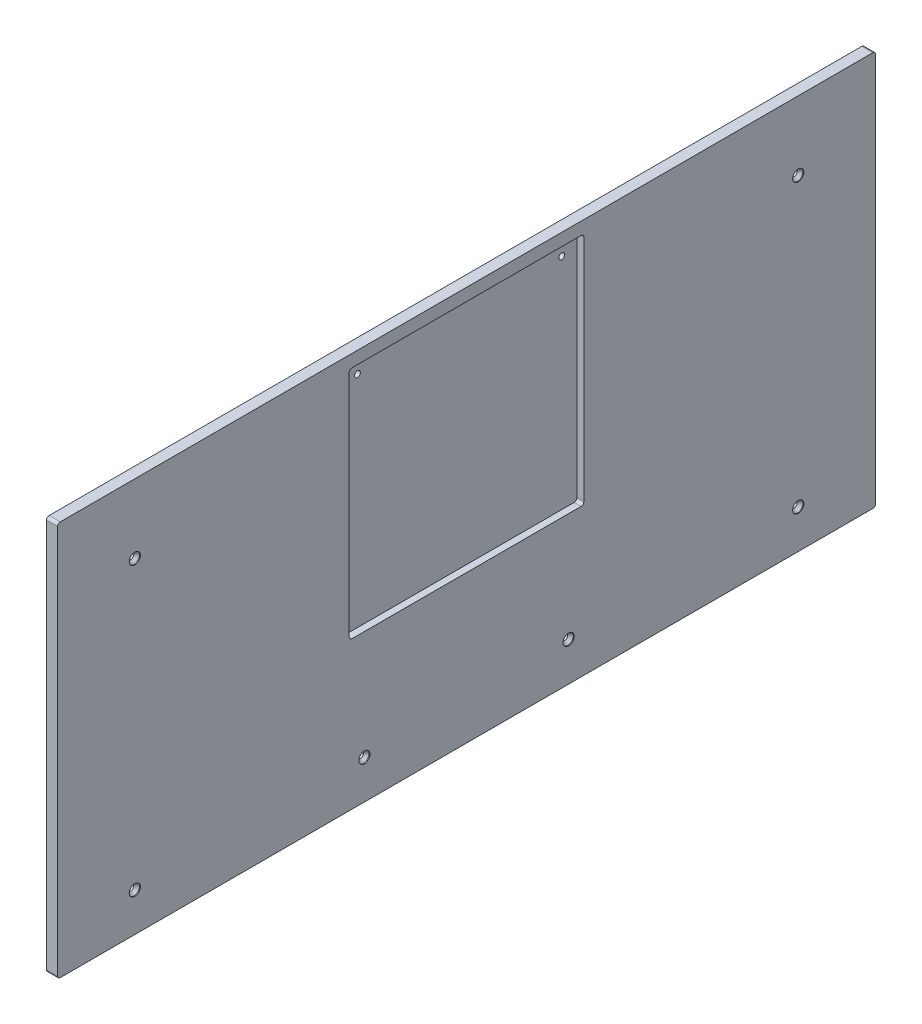
ISO-10303-21;
HEADER;
FILE_DESCRIPTION(('STEP AP214'),'2;1');
FILE_NAME('part.step','',(''),(''),'','','');
FILE_SCHEMA(('AUTOMOTIVE_DESIGN { 1 0 10303 214 1 1 1 1 }'));
ENDSEC;
DATA;
#1=APPLICATION_CONTEXT('core data for automotive mechanical design processes');
#2=APPLICATION_PROTOCOL_DEFINITION('international standard','automotive_design',2000,#1);
#3=PRODUCT_CONTEXT('',#1,'mechanical');
#4=PRODUCT('Part','Part','',(#3));
#5=PRODUCT_RELATED_PRODUCT_CATEGORY('part','',(#4));
#6=PRODUCT_DEFINITION_FORMATION('','',#4);
#7=PRODUCT_DEFINITION_CONTEXT('part definition',#1,'design');
#8=PRODUCT_DEFINITION('design','',#6,#7);
#9=PRODUCT_DEFINITION_SHAPE('','',#8);
#10=(LENGTH_UNIT() NAMED_UNIT(*) SI_UNIT(.MILLI.,.METRE.));
#11=(NAMED_UNIT(*) PLANE_ANGLE_UNIT() SI_UNIT($,.RADIAN.));
#12=(NAMED_UNIT(*) SI_UNIT($,.STERADIAN.) SOLID_ANGLE_UNIT());
#13=UNCERTAINTY_MEASURE_WITH_UNIT(LENGTH_MEASURE(1.E-05),#10,'distance_accuracy_value','');
#14=(GEOMETRIC_REPRESENTATION_CONTEXT(3) GLOBAL_UNCERTAINTY_ASSIGNED_CONTEXT((#13)) GLOBAL_UNIT_ASSIGNED_CONTEXT((#10,
#11,#12)) REPRESENTATION_CONTEXT('',''));
#15=CARTESIAN_POINT('',(0.,0.,0.));
#16=DIRECTION('',(0.,0.,1.));
#17=DIRECTION('',(1.,0.,0.));
#18=AXIS2_PLACEMENT_3D('',#15,#16,#17);
#19=CARTESIAN_POINT('',(0.,0.,0.));
#20=DIRECTION('',(-1.,0.,0.));
#21=DIRECTION('',(0.,0.,1.));
#22=AXIS2_PLACEMENT_3D('',#19,#20,#21);
#23=PLANE('',#22);
#24=CARTESIAN_POINT('',(0.,374.65,-88.9));
#25=DIRECTION('',(1.,0.,0.));
#26=DIRECTION('',(0.,0.,-1.));
#27=AXIS2_PLACEMENT_3D('',#24,#25,#26);
#28=CIRCLE('',#27,3.3782);
#29=CARTESIAN_POINT('',(0.,374.65,-92.2782));
#30=VERTEX_POINT('',#29);
#31=EDGE_CURVE('E509',#30,#30,#28,.T.);
#32=ORIENTED_EDGE('',*,*,#31,.T.);
#33=EDGE_LOOP('',(#32));
#34=FACE_BOUND('',#33,.T.);
#35=CARTESIAN_POINT('',(0.,374.65,-851.98204));
#36=DIRECTION('',(1.,0.,0.));
#37=DIRECTION('',(0.,0.,-1.));
#38=AXIS2_PLACEMENT_3D('',#35,#36,#37);
#39=CIRCLE('',#38,3.3782);
#40=CARTESIAN_POINT('',(0.,374.65,-855.36024));
#41=VERTEX_POINT('',#40);
#42=EDGE_CURVE('E524',#41,#41,#39,.T.);
#43=ORIENTED_EDGE('',*,*,#42,.T.);
#44=EDGE_LOOP('',(#43));
#45=FACE_BOUND('',#44,.T.);
#46=CARTESIAN_POINT('',(0.,44.45,-88.9));
#47=DIRECTION('',(1.,0.,0.));
#48=DIRECTION('',(0.,0.,-1.));
#49=AXIS2_PLACEMENT_3D('',#46,#47,#48);
#50=CIRCLE('',#49,3.3782);
#51=CARTESIAN_POINT('',(0.,44.45,-92.2782));
#52=VERTEX_POINT('',#51);
#53=EDGE_CURVE('E540',#52,#52,#50,.T.);
#54=ORIENTED_EDGE('',*,*,#53,.T.);
#55=EDGE_LOOP('',(#54));
#56=FACE_BOUND('',#55,.T.);
#57=CARTESIAN_POINT('',(0.,44.45,-352.96602));
#58=DIRECTION('',(1.,0.,0.));
#59=DIRECTION('',(0.,0.,-1.));
#60=AXIS2_PLACEMENT_3D('',#57,#58,#59);
#61=CIRCLE('',#60,3.3782);
#62=CARTESIAN_POINT('',(0.,44.45,-356.34422));
#63=VERTEX_POINT('',#62);
#64=EDGE_CURVE('E556',#63,#63,#61,.T.);
#65=ORIENTED_EDGE('',*,*,#64,.T.);
#66=EDGE_LOOP('',(#65));
#67=FACE_BOUND('',#66,.T.);
#68=CARTESIAN_POINT('',(0.,422.275,-587.91602));
#69=DIRECTION('',(1.,0.,0.));
#70=DIRECTION('',(0.,0.,-1.));
#71=AXIS2_PLACEMENT_3D('',#68,#69,#70);
#72=CIRCLE('',#71,3.37343749999991);
#73=CARTESIAN_POINT('',(0.,422.275,-591.2894575));
#74=VERTEX_POINT('',#73);
#75=EDGE_CURVE('E338',#74,#74,#72,.T.);
#76=ORIENTED_EDGE('',*,*,#75,.T.);
#77=EDGE_LOOP('',(#76));
#78=FACE_BOUND('',#77,.T.);
#79=DIRECTION('',(0.,0.,1.));
#80=VECTOR('',#79,1.);
#81=CARTESIAN_POINT('',(0.,454.025,0.));
#82=LINE('',#81,#80);
#83=CARTESIAN_POINT('',(0.,454.025,-937.70704));
#84=VERTEX_POINT('',#83);
#85=CARTESIAN_POINT('',(0.,454.025,-3.175));
#86=VERTEX_POINT('',#85);
#87=EDGE_CURVE('E169',#84,#86,#82,.T.);
#88=ORIENTED_EDGE('',*,*,#87,.F.);
#89=CARTESIAN_POINT('',(0.,450.85,-937.70704));
#90=DIRECTION('',(-1.,0.,0.));
#91=DIRECTION('',(0.,0.,1.));
#92=AXIS2_PLACEMENT_3D('',#89,#90,#91);
#93=CIRCLE('',#92,3.175);
#94=CARTESIAN_POINT('',(0.,450.85,-940.88204));
#95=VERTEX_POINT('',#94);
#96=EDGE_CURVE('E151',#84,#95,#93,.T.);
#97=ORIENTED_EDGE('',*,*,#96,.T.);
#98=DIRECTION('',(0.,1.,0.));
#99=VECTOR('',#98,1.);
#100=CARTESIAN_POINT('',(0.,0.,-940.88204));
#101=LINE('',#100,#99);
#102=CARTESIAN_POINT('',(0.,3.175,-940.88204));
#103=VERTEX_POINT('',#102);
#104=EDGE_CURVE('E181',#103,#95,#101,.T.);
#105=ORIENTED_EDGE('',*,*,#104,.F.);
#106=CARTESIAN_POINT('',(0.,3.175,-937.70704));
#107=DIRECTION('',(-1.,0.,0.));
#108=DIRECTION('',(0.,0.,1.));
#109=AXIS2_PLACEMENT_3D('',#106,#107,#108);
#110=CIRCLE('',#109,3.175);
#111=CARTESIAN_POINT('',(0.,0.,-937.70704));
#112=VERTEX_POINT('',#111);
#113=EDGE_CURVE('E163',#103,#112,#110,.T.);
#114=ORIENTED_EDGE('',*,*,#113,.T.);
#115=DIRECTION('',(0.,0.,-1.));
#116=VECTOR('',#115,1.);
#117=CARTESIAN_POINT('',(0.,0.,0.));
#118=LINE('',#117,#116);
#119=CARTESIAN_POINT('',(0.,0.,-3.175));
#120=VERTEX_POINT('',#119);
#121=EDGE_CURVE('E189',#120,#112,#118,.T.);
#122=ORIENTED_EDGE('',*,*,#121,.F.);
#123=CARTESIAN_POINT('',(0.,3.175,-3.175));
#124=DIRECTION('',(-1.,0.,0.));
#125=DIRECTION('',(0.,0.,1.));
#126=AXIS2_PLACEMENT_3D('',#123,#124,#125);
#127=CIRCLE('',#126,3.175);
#128=CARTESIAN_POINT('',(0.,3.175,0.));
#129=VERTEX_POINT('',#128);
#130=EDGE_CURVE('E197',#120,#129,#127,.T.);
#131=ORIENTED_EDGE('',*,*,#130,.T.);
#132=DIRECTION('',(0.,-1.,0.));
#133=VECTOR('',#132,1.);
#134=CARTESIAN_POINT('',(0.,0.,0.));
#135=LINE('',#134,#133);
#136=CARTESIAN_POINT('',(0.,450.85,0.));
#137=VERTEX_POINT('',#136);
#138=EDGE_CURVE('E345',#137,#129,#135,.T.);
#139=ORIENTED_EDGE('',*,*,#138,.F.);
#140=CARTESIAN_POINT('',(0.,450.85,-3.175));
#141=DIRECTION('',(-1.,0.,0.));
#142=DIRECTION('',(0.,0.,1.));
#143=AXIS2_PLACEMENT_3D('',#140,#141,#142);
#144=CIRCLE('',#143,3.175);
#145=EDGE_CURVE('E174',#137,#86,#144,.T.);
#146=ORIENTED_EDGE('',*,*,#145,.T.);
#147=EDGE_LOOP('',(#88,#97,#105,#114,#122,#131,#139,#146));
#148=FACE_BOUND('',#147,.T.);
#149=CARTESIAN_POINT('',(0.,422.275,-352.96602));
#150=DIRECTION('',(1.,0.,0.));
#151=DIRECTION('',(0.,0.,-1.));
#152=AXIS2_PLACEMENT_3D('',#149,#150,#151);
#153=CIRCLE('',#152,3.37343750000003);
#154=CARTESIAN_POINT('',(0.,422.275,-356.3394575));
#155=VERTEX_POINT('',#154);
#156=EDGE_CURVE('E342',#155,#155,#153,.T.);
#157=ORIENTED_EDGE('',*,*,#156,.T.);
#158=EDGE_LOOP('',(#157));
#159=FACE_BOUND('',#158,.T.);
#160=CARTESIAN_POINT('',(0.,44.45,-851.98204));
#161=DIRECTION('',(1.,0.,0.));
#162=DIRECTION('',(0.,0.,-1.));
#163=AXIS2_PLACEMENT_3D('',#160,#161,#162);
#164=CIRCLE('',#163,3.3782);
#165=CARTESIAN_POINT('',(0.,44.45,-855.36024));
#166=VERTEX_POINT('',#165);
#167=EDGE_CURVE('E297',#166,#166,#164,.T.);
#168=ORIENTED_EDGE('',*,*,#167,.T.);
#169=EDGE_LOOP('',(#168));
#170=FACE_BOUND('',#169,.T.);
#171=CARTESIAN_POINT('',(0.,44.45,-587.91602));
#172=DIRECTION('',(1.,0.,0.));
#173=DIRECTION('',(0.,0.,-1.));
#174=AXIS2_PLACEMENT_3D('',#171,#172,#173);
#175=CIRCLE('',#174,3.3782);
#176=CARTESIAN_POINT('',(0.,44.45,-591.29422));
#177=VERTEX_POINT('',#176);
#178=EDGE_CURVE('E572',#177,#177,#175,.T.);
#179=ORIENTED_EDGE('',*,*,#178,.T.);
#180=EDGE_LOOP('',(#179));
#181=FACE_BOUND('',#180,.T.);
#182=ADVANCED_FACE('F38',(#34,#45,#56,#67,#78,#148,#159,#170,#181),#23,.T.);
#183=CARTESIAN_POINT('',(12.7,422.275,-352.96602));
#184=DIRECTION('',(-1.,0.,0.));
#185=DIRECTION('',(0.,0.,1.));
#186=AXIS2_PLACEMENT_3D('',#183,#184,#185);
#187=CYLINDRICAL_SURFACE('',#186,3.37343750000003);
#188=ORIENTED_EDGE('',*,*,#156,.F.);
#189=EDGE_LOOP('',(#188));
#190=FACE_BOUND('',#189,.T.);
#191=CARTESIAN_POINT('',(4.7625,422.275,-352.96602));
#192=DIRECTION('',(1.,0.,0.));
#193=DIRECTION('',(0.,0.,-1.));
#194=AXIS2_PLACEMENT_3D('',#191,#192,#193);
#195=CIRCLE('',#194,3.37343750000003);
#196=CARTESIAN_POINT('',(4.7625,422.275,-356.3394575));
#197=VERTEX_POINT('',#196);
#198=EDGE_CURVE('E238',#197,#197,#195,.T.);
#199=ORIENTED_EDGE('',*,*,#198,.T.);
#200=EDGE_LOOP('',(#199));
#201=FACE_BOUND('',#200,.T.);
#202=ADVANCED_FACE('F384',(#190,#201),#187,.F.);
#203=CARTESIAN_POINT('',(12.7,422.275,-587.91602));
#204=DIRECTION('',(-1.,0.,0.));
#205=DIRECTION('',(0.,0.,1.));
#206=AXIS2_PLACEMENT_3D('',#203,#204,#205);
#207=CYLINDRICAL_SURFACE('',#206,3.37343749999991);
#208=ORIENTED_EDGE('',*,*,#75,.F.);
#209=EDGE_LOOP('',(#208));
#210=FACE_BOUND('',#209,.T.);
#211=CARTESIAN_POINT('',(4.7625,422.275,-587.91602));
#212=DIRECTION('',(1.,0.,0.));
#213=DIRECTION('',(0.,0.,-1.));
#214=AXIS2_PLACEMENT_3D('',#211,#212,#213);
#215=CIRCLE('',#214,3.37343749999991);
#216=CARTESIAN_POINT('',(4.7625,422.275,-591.2894575));
#217=VERTEX_POINT('',#216);
#218=EDGE_CURVE('E234',#217,#217,#215,.T.);
#219=ORIENTED_EDGE('',*,*,#218,.T.);
#220=EDGE_LOOP('',(#219));
#221=FACE_BOUND('',#220,.T.);
#222=ADVANCED_FACE('F390',(#210,#221),#207,.F.);
#223=CARTESIAN_POINT('',(12.7,0.,0.));
#224=DIRECTION('',(-1.,0.,0.));
#225=DIRECTION('',(0.,0.,1.));
#226=AXIS2_PLACEMENT_3D('',#223,#224,#225);
#227=PLANE('',#226);
#228=CARTESIAN_POINT('',(12.7,374.65,-88.9));
#229=DIRECTION('',(1.,0.,0.));
#230=DIRECTION('',(0.,0.,-1.));
#231=AXIS2_PLACEMENT_3D('',#228,#229,#230);
#232=CIRCLE('',#231,6.43890000000003);
#233=CARTESIAN_POINT('',(12.7,374.65,-95.3389));
#234=VERTEX_POINT('',#233);
#235=EDGE_CURVE('E498',#234,#234,#232,.T.);
#236=ORIENTED_EDGE('',*,*,#235,.F.);
#237=EDGE_LOOP('',(#236));
#238=FACE_BOUND('',#237,.T.);
#239=CARTESIAN_POINT('',(12.7,374.65,-851.98204));
#240=DIRECTION('',(1.,0.,0.));
#241=DIRECTION('',(0.,0.,-1.));
#242=AXIS2_PLACEMENT_3D('',#239,#240,#241);
#243=CIRCLE('',#242,6.43890000000003);
#244=CARTESIAN_POINT('',(12.7,374.65,-858.42094));
#245=VERTEX_POINT('',#244);
#246=EDGE_CURVE('E512',#245,#245,#243,.T.);
#247=ORIENTED_EDGE('',*,*,#246,.F.);
#248=EDGE_LOOP('',(#247));
#249=FACE_BOUND('',#248,.T.);
#250=CARTESIAN_POINT('',(12.7,44.45,-88.9));
#251=DIRECTION('',(1.,0.,0.));
#252=DIRECTION('',(0.,0.,-1.));
#253=AXIS2_PLACEMENT_3D('',#250,#251,#252);
#254=CIRCLE('',#253,6.4389);
#255=CARTESIAN_POINT('',(12.7,44.45,-95.3389));
#256=VERTEX_POINT('',#255);
#257=EDGE_CURVE('E528',#256,#256,#254,.T.);
#258=ORIENTED_EDGE('',*,*,#257,.F.);
#259=EDGE_LOOP('',(#258));
#260=FACE_BOUND('',#259,.T.);
#261=CARTESIAN_POINT('',(12.7,44.45,-352.96602));
#262=DIRECTION('',(1.,0.,0.));
#263=DIRECTION('',(0.,0.,-1.));
#264=AXIS2_PLACEMENT_3D('',#261,#262,#263);
#265=CIRCLE('',#264,6.4389);
#266=CARTESIAN_POINT('',(12.7,44.45,-359.40492));
#267=VERTEX_POINT('',#266);
#268=EDGE_CURVE('E544',#267,#267,#265,.T.);
#269=ORIENTED_EDGE('',*,*,#268,.F.);
#270=EDGE_LOOP('',(#269));
#271=FACE_BOUND('',#270,.T.);
#272=CARTESIAN_POINT('',(12.7,44.45,-587.91602));
#273=DIRECTION('',(1.,0.,0.));
#274=DIRECTION('',(0.,0.,-1.));
#275=AXIS2_PLACEMENT_3D('',#272,#273,#274);
#276=CIRCLE('',#275,6.4389);
#277=CARTESIAN_POINT('',(12.7,44.45,-594.35492));
#278=VERTEX_POINT('',#277);
#279=EDGE_CURVE('E560',#278,#278,#276,.T.);
#280=ORIENTED_EDGE('',*,*,#279,.F.);
#281=EDGE_LOOP('',(#280));
#282=FACE_BOUND('',#281,.T.);
#283=CARTESIAN_POINT('',(12.7,44.45,-851.98204));
#284=DIRECTION('',(1.,0.,0.));
#285=DIRECTION('',(0.,0.,-1.));
#286=AXIS2_PLACEMENT_3D('',#283,#284,#285);
#287=CIRCLE('',#286,6.4389);
#288=CARTESIAN_POINT('',(12.7,44.45,-858.42094));
#289=VERTEX_POINT('',#288);
#290=EDGE_CURVE('E576',#289,#289,#287,.T.);
#291=ORIENTED_EDGE('',*,*,#290,.F.);
#292=EDGE_LOOP('',(#291));
#293=FACE_BOUND('',#292,.T.);
#294=DIRECTION('',(0.,0.,-1.));
#295=VECTOR('',#294,1.);
#296=CARTESIAN_POINT('',(12.7,169.8625,-335.50352));
#297=LINE('',#296,#295);
#298=CARTESIAN_POINT('',(12.7,169.8625,-338.67852));
#299=VERTEX_POINT('',#298);
#300=CARTESIAN_POINT('',(12.7,169.8625,-602.20352));
#301=VERTEX_POINT('',#300);
#302=EDGE_CURVE('E290',#299,#301,#297,.T.);
#303=ORIENTED_EDGE('',*,*,#302,.F.);
#304=CARTESIAN_POINT('',(12.7,173.0375,-338.67852));
#305=DIRECTION('',(-1.,0.,0.));
#306=DIRECTION('',(0.,0.,1.));
#307=AXIS2_PLACEMENT_3D('',#304,#305,#306);
#308=CIRCLE('',#307,3.175);
#309=CARTESIAN_POINT('',(12.7,173.0375,-335.50352));
#310=VERTEX_POINT('',#309);
#311=EDGE_CURVE('E47',#299,#310,#308,.T.);
#312=ORIENTED_EDGE('',*,*,#311,.T.);
#313=DIRECTION('',(0.,-1.,0.));
#314=VECTOR('',#313,1.);
#315=CARTESIAN_POINT('',(12.7,439.7375,-335.50352));
#316=LINE('',#315,#314);
#317=CARTESIAN_POINT('',(12.7,436.5625,-335.50352));
#318=VERTEX_POINT('',#317);
#319=EDGE_CURVE('E289',#318,#310,#316,.T.);
#320=ORIENTED_EDGE('',*,*,#319,.F.);
#321=CARTESIAN_POINT('',(12.7,436.5625,-338.67852));
#322=DIRECTION('',(-1.,0.,0.));
#323=DIRECTION('',(0.,0.,1.));
#324=AXIS2_PLACEMENT_3D('',#321,#322,#323);
#325=CIRCLE('',#324,3.175);
#326=CARTESIAN_POINT('',(12.7,439.7375,-338.67852));
#327=VERTEX_POINT('',#326);
#328=EDGE_CURVE('E278',#318,#327,#325,.T.);
#329=ORIENTED_EDGE('',*,*,#328,.T.);
#330=DIRECTION('',(0.,0.,1.));
#331=VECTOR('',#330,1.);
#332=CARTESIAN_POINT('',(12.7,439.7375,-335.50352));
#333=LINE('',#332,#331);
#334=CARTESIAN_POINT('',(12.7,439.7375,-602.20352));
#335=VERTEX_POINT('',#334);
#336=EDGE_CURVE('E320',#335,#327,#333,.T.);
#337=ORIENTED_EDGE('',*,*,#336,.F.);
#338=CARTESIAN_POINT('',(12.7,436.5625,-602.20352));
#339=DIRECTION('',(-1.,0.,0.));
#340=DIRECTION('',(0.,0.,1.));
#341=AXIS2_PLACEMENT_3D('',#338,#339,#340);
#342=CIRCLE('',#341,3.175);
#343=CARTESIAN_POINT('',(12.7,436.5625,-605.37852));
#344=VERTEX_POINT('',#343);
#345=EDGE_CURVE('E281',#335,#344,#342,.T.);
#346=ORIENTED_EDGE('',*,*,#345,.T.);
#347=DIRECTION('',(0.,1.,0.));
#348=VECTOR('',#347,1.);
#349=CARTESIAN_POINT('',(12.7,439.7375,-605.37852));
#350=LINE('',#349,#348);
#351=CARTESIAN_POINT('',(12.7,173.0375,-605.37852));
#352=VERTEX_POINT('',#351);
#353=EDGE_CURVE('E328',#352,#344,#350,.T.);
#354=ORIENTED_EDGE('',*,*,#353,.F.);
#355=CARTESIAN_POINT('',(12.7,173.0375,-602.20352));
#356=DIRECTION('',(-1.,0.,0.));
#357=DIRECTION('',(0.,0.,1.));
#358=AXIS2_PLACEMENT_3D('',#355,#356,#357);
#359=CIRCLE('',#358,3.175);
#360=EDGE_CURVE('E11',#352,#301,#359,.T.);
#361=ORIENTED_EDGE('',*,*,#360,.T.);
#362=EDGE_LOOP('',(#303,#312,#320,#329,#337,#346,#354,#361));
#363=FACE_BOUND('',#362,.T.);
#364=DIRECTION('',(0.,1.,0.));
#365=VECTOR('',#364,1.);
#366=CARTESIAN_POINT('',(12.7,0.,-940.88204));
#367=LINE('',#366,#365);
#368=CARTESIAN_POINT('',(12.7,3.175,-940.88204));
#369=VERTEX_POINT('',#368);
#370=CARTESIAN_POINT('',(12.7,450.85,-940.88204));
#371=VERTEX_POINT('',#370);
#372=EDGE_CURVE('E350',#369,#371,#367,.T.);
#373=ORIENTED_EDGE('',*,*,#372,.T.);
#374=CARTESIAN_POINT('',(12.7,450.85,-937.70704));
#375=DIRECTION('',(-1.,0.,0.));
#376=DIRECTION('',(0.,0.,1.));
#377=AXIS2_PLACEMENT_3D('',#374,#375,#376);
#378=CIRCLE('',#377,3.175);
#379=CARTESIAN_POINT('',(12.7,454.025,-937.70704));
#380=VERTEX_POINT('',#379);
#381=EDGE_CURVE('E216',#371,#380,#378,.F.);
#382=ORIENTED_EDGE('',*,*,#381,.T.);
#383=DIRECTION('',(0.,0.,1.));
#384=VECTOR('',#383,1.);
#385=CARTESIAN_POINT('',(12.7,454.025,0.));
#386=LINE('',#385,#384);
#387=CARTESIAN_POINT('',(12.7,454.025,-3.175));
#388=VERTEX_POINT('',#387);
#389=EDGE_CURVE('E172',#380,#388,#386,.T.);
#390=ORIENTED_EDGE('',*,*,#389,.T.);
#391=CARTESIAN_POINT('',(12.7,450.85,-3.175));
#392=DIRECTION('',(-1.,0.,0.));
#393=DIRECTION('',(0.,0.,1.));
#394=AXIS2_PLACEMENT_3D('',#391,#392,#393);
#395=CIRCLE('',#394,3.175);
#396=CARTESIAN_POINT('',(12.7,450.85,0.));
#397=VERTEX_POINT('',#396);
#398=EDGE_CURVE('E207',#388,#397,#395,.F.);
#399=ORIENTED_EDGE('',*,*,#398,.T.);
#400=DIRECTION('',(0.,-1.,0.));
#401=VECTOR('',#400,1.);
#402=CARTESIAN_POINT('',(12.7,0.,0.));
#403=LINE('',#402,#401);
#404=CARTESIAN_POINT('',(12.7,3.175,0.));
#405=VERTEX_POINT('',#404);
#406=EDGE_CURVE('E180',#397,#405,#403,.T.);
#407=ORIENTED_EDGE('',*,*,#406,.T.);
#408=CARTESIAN_POINT('',(12.7,3.175,-3.175));
#409=DIRECTION('',(-1.,0.,0.));
#410=DIRECTION('',(0.,0.,1.));
#411=AXIS2_PLACEMENT_3D('',#408,#409,#410);
#412=CIRCLE('',#411,3.175);
#413=CARTESIAN_POINT('',(12.7,0.,-3.175));
#414=VERTEX_POINT('',#413);
#415=EDGE_CURVE('E210',#405,#414,#412,.F.);
#416=ORIENTED_EDGE('',*,*,#415,.T.);
#417=DIRECTION('',(0.,0.,-1.));
#418=VECTOR('',#417,1.);
#419=CARTESIAN_POINT('',(12.7,0.,0.));
#420=LINE('',#419,#418);
#421=CARTESIAN_POINT('',(12.7,0.,-937.70704));
#422=VERTEX_POINT('',#421);
#423=EDGE_CURVE('E187',#414,#422,#420,.T.);
#424=ORIENTED_EDGE('',*,*,#423,.T.);
#425=CARTESIAN_POINT('',(12.7,3.175,-937.70704));
#426=DIRECTION('',(-1.,0.,0.));
#427=DIRECTION('',(0.,0.,1.));
#428=AXIS2_PLACEMENT_3D('',#425,#426,#427);
#429=CIRCLE('',#428,3.175);
#430=EDGE_CURVE('E213',#422,#369,#429,.F.);
#431=ORIENTED_EDGE('',*,*,#430,.T.);
#432=EDGE_LOOP('',(#373,#382,#390,#399,#407,#416,#424,#431));
#433=FACE_BOUND('',#432,.T.);
#434=ADVANCED_FACE('F287',(#238,#249,#260,#271,#282,#293,#363,#433),#227,.F.);
#435=CARTESIAN_POINT('',(12.7,0.,0.));
#436=DIRECTION('',(0.,0.,-1.));
#437=DIRECTION('',(-1.,0.,0.));
#438=AXIS2_PLACEMENT_3D('',#435,#436,#437);
#439=PLANE('',#438);
#440=ORIENTED_EDGE('',*,*,#138,.T.);
#441=DIRECTION('',(-1.,0.,0.));
#442=VECTOR('',#441,1.);
#443=CARTESIAN_POINT('',(12.7,3.175,0.));
#444=LINE('',#443,#442);
#445=EDGE_CURVE('E230',#129,#405,#444,.F.);
#446=ORIENTED_EDGE('',*,*,#445,.T.);
#447=ORIENTED_EDGE('',*,*,#406,.F.);
#448=DIRECTION('',(-1.,0.,0.));
#449=VECTOR('',#448,1.);
#450=CARTESIAN_POINT('',(12.7,450.85,0.));
#451=LINE('',#450,#449);
#452=EDGE_CURVE('E226',#397,#137,#451,.T.);
#453=ORIENTED_EDGE('',*,*,#452,.T.);
#454=EDGE_LOOP('',(#440,#446,#447,#453));
#455=FACE_BOUND('',#454,.T.);
#456=ADVANCED_FACE('F381',(#455),#439,.F.);
#457=CARTESIAN_POINT('',(12.7,0.,0.));
#458=DIRECTION('',(0.,1.,0.));
#459=DIRECTION('',(0.,0.,1.));
#460=AXIS2_PLACEMENT_3D('',#457,#458,#459);
#461=PLANE('',#460);
#462=ORIENTED_EDGE('',*,*,#121,.T.);
#463=DIRECTION('',(-1.,0.,0.));
#464=VECTOR('',#463,1.);
#465=CARTESIAN_POINT('',(12.7,0.,-937.70704));
#466=LINE('',#465,#464);
#467=EDGE_CURVE('E223',#112,#422,#466,.F.);
#468=ORIENTED_EDGE('',*,*,#467,.T.);
#469=ORIENTED_EDGE('',*,*,#423,.F.);
#470=DIRECTION('',(-1.,0.,0.));
#471=VECTOR('',#470,1.);
#472=CARTESIAN_POINT('',(12.7,0.,-3.175));
#473=LINE('',#472,#471);
#474=EDGE_CURVE('E219',#414,#120,#473,.T.);
#475=ORIENTED_EDGE('',*,*,#474,.T.);
#476=EDGE_LOOP('',(#462,#468,#469,#475));
#477=FACE_BOUND('',#476,.T.);
#478=ADVANCED_FACE('F364',(#477),#461,.F.);
#479=CARTESIAN_POINT('',(12.7,0.,-940.88204));
#480=DIRECTION('',(0.,0.,1.));
#481=DIRECTION('',(1.,0.,0.));
#482=AXIS2_PLACEMENT_3D('',#479,#480,#481);
#483=PLANE('',#482);
#484=ORIENTED_EDGE('',*,*,#104,.T.);
#485=DIRECTION('',(-1.,0.,0.));
#486=VECTOR('',#485,1.);
#487=CARTESIAN_POINT('',(12.7,450.85,-940.88204));
#488=LINE('',#487,#486);
#489=EDGE_CURVE('E156',#95,#371,#488,.F.);
#490=ORIENTED_EDGE('',*,*,#489,.T.);
#491=ORIENTED_EDGE('',*,*,#372,.F.);
#492=DIRECTION('',(-1.,0.,0.));
#493=VECTOR('',#492,1.);
#494=CARTESIAN_POINT('',(12.7,3.175,-940.88204));
#495=LINE('',#494,#493);
#496=EDGE_CURVE('E162',#369,#103,#495,.T.);
#497=ORIENTED_EDGE('',*,*,#496,.T.);
#498=EDGE_LOOP('',(#484,#490,#491,#497));
#499=FACE_BOUND('',#498,.T.);
#500=ADVANCED_FACE('F373',(#499),#483,.F.);
#501=CARTESIAN_POINT('',(12.7,454.025,0.));
#502=DIRECTION('',(0.,-1.,0.));
#503=DIRECTION('',(0.,0.,-1.));
#504=AXIS2_PLACEMENT_3D('',#501,#502,#503);
#505=PLANE('',#504);
#506=ORIENTED_EDGE('',*,*,#389,.F.);
#507=DIRECTION('',(-1.,0.,0.));
#508=VECTOR('',#507,1.);
#509=CARTESIAN_POINT('',(12.7,454.025,-937.70704));
#510=LINE('',#509,#508);
#511=EDGE_CURVE('E155',#380,#84,#510,.T.);
#512=ORIENTED_EDGE('',*,*,#511,.T.);
#513=ORIENTED_EDGE('',*,*,#87,.T.);
#514=DIRECTION('',(-1.,0.,0.));
#515=VECTOR('',#514,1.);
#516=CARTESIAN_POINT('',(12.7,454.025,-3.175));
#517=LINE('',#516,#515);
#518=EDGE_CURVE('E175',#86,#388,#517,.F.);
#519=ORIENTED_EDGE('',*,*,#518,.T.);
#520=EDGE_LOOP('',(#506,#512,#513,#519));
#521=FACE_BOUND('',#520,.T.);
#522=ADVANCED_FACE('F168',(#521),#505,.F.);
#523=CARTESIAN_POINT('',(12.7,450.85,-937.70704));
#524=DIRECTION('',(-1.,0.,0.));
#525=DIRECTION('',(0.,0.,1.));
#526=AXIS2_PLACEMENT_3D('',#523,#524,#525);
#527=CYLINDRICAL_SURFACE('',#526,3.175);
#528=ORIENTED_EDGE('',*,*,#381,.F.);
#529=ORIENTED_EDGE('',*,*,#489,.F.);
#530=ORIENTED_EDGE('',*,*,#96,.F.);
#531=ORIENTED_EDGE('',*,*,#511,.F.);
#532=EDGE_LOOP('',(#528,#529,#530,#531));
#533=FACE_BOUND('',#532,.T.);
#534=ADVANCED_FACE('F154',(#533),#527,.T.);
#535=CARTESIAN_POINT('',(12.7,3.175,-937.70704));
#536=DIRECTION('',(-1.,0.,0.));
#537=DIRECTION('',(0.,0.,1.));
#538=AXIS2_PLACEMENT_3D('',#535,#536,#537);
#539=CYLINDRICAL_SURFACE('',#538,3.175);
#540=ORIENTED_EDGE('',*,*,#430,.F.);
#541=ORIENTED_EDGE('',*,*,#467,.F.);
#542=ORIENTED_EDGE('',*,*,#113,.F.);
#543=ORIENTED_EDGE('',*,*,#496,.F.);
#544=EDGE_LOOP('',(#540,#541,#542,#543));
#545=FACE_BOUND('',#544,.T.);
#546=ADVANCED_FACE('F369',(#545),#539,.T.);
#547=CARTESIAN_POINT('',(12.7,3.175,-3.175));
#548=DIRECTION('',(-1.,0.,0.));
#549=DIRECTION('',(0.,0.,1.));
#550=AXIS2_PLACEMENT_3D('',#547,#548,#549);
#551=CYLINDRICAL_SURFACE('',#550,3.175);
#552=ORIENTED_EDGE('',*,*,#415,.F.);
#553=ORIENTED_EDGE('',*,*,#445,.F.);
#554=ORIENTED_EDGE('',*,*,#130,.F.);
#555=ORIENTED_EDGE('',*,*,#474,.F.);
#556=EDGE_LOOP('',(#552,#553,#554,#555));
#557=FACE_BOUND('',#556,.T.);
#558=ADVANCED_FACE('F790',(#557),#551,.T.);
#559=CARTESIAN_POINT('',(12.7,450.85,-3.175));
#560=DIRECTION('',(-1.,0.,0.));
#561=DIRECTION('',(0.,0.,1.));
#562=AXIS2_PLACEMENT_3D('',#559,#560,#561);
#563=CYLINDRICAL_SURFACE('',#562,3.175);
#564=ORIENTED_EDGE('',*,*,#398,.F.);
#565=ORIENTED_EDGE('',*,*,#518,.F.);
#566=ORIENTED_EDGE('',*,*,#145,.F.);
#567=ORIENTED_EDGE('',*,*,#452,.F.);
#568=EDGE_LOOP('',(#564,#565,#566,#567));
#569=FACE_BOUND('',#568,.T.);
#570=ADVANCED_FACE('F405',(#569),#563,.T.);
#571=CARTESIAN_POINT('',(4.7625,439.7375,-335.50352));
#572=DIRECTION('',(0.,0.,1.));
#573=DIRECTION('',(0.,-1.,0.));
#574=AXIS2_PLACEMENT_3D('',#571,#572,#573);
#575=PLANE('',#574);
#576=DIRECTION('',(0.,-1.,0.));
#577=VECTOR('',#576,1.);
#578=CARTESIAN_POINT('',(4.7625,439.7375,-335.50352));
#579=LINE('',#578,#577);
#580=CARTESIAN_POINT('',(4.7625,436.5625,-335.50352));
#581=VERTEX_POINT('',#580);
#582=CARTESIAN_POINT('',(4.7625,173.0375,-335.50352));
#583=VERTEX_POINT('',#582);
#584=EDGE_CURVE('E308',#581,#583,#579,.T.);
#585=ORIENTED_EDGE('',*,*,#584,.F.);
#586=DIRECTION('',(1.,0.,0.));
#587=VECTOR('',#586,1.);
#588=CARTESIAN_POINT('',(12.7,436.5625,-335.50352));
#589=LINE('',#588,#587);
#590=EDGE_CURVE('E242',#581,#318,#589,.T.);
#591=ORIENTED_EDGE('',*,*,#590,.T.);
#592=ORIENTED_EDGE('',*,*,#319,.T.);
#593=DIRECTION('',(1.,0.,0.));
#594=VECTOR('',#593,1.);
#595=CARTESIAN_POINT('',(4.7625,173.0375,-335.50352));
#596=LINE('',#595,#594);
#597=EDGE_CURVE('E233',#310,#583,#596,.F.);
#598=ORIENTED_EDGE('',*,*,#597,.T.);
#599=EDGE_LOOP('',(#585,#591,#592,#598));
#600=FACE_BOUND('',#599,.T.);
#601=ADVANCED_FACE('F293',(#600),#575,.F.);
#602=CARTESIAN_POINT('',(4.7625,439.7375,-335.50352));
#603=DIRECTION('',(0.,1.,0.));
#604=DIRECTION('',(0.,0.,1.));
#605=AXIS2_PLACEMENT_3D('',#602,#603,#604);
#606=PLANE('',#605);
#607=ORIENTED_EDGE('',*,*,#336,.T.);
#608=DIRECTION('',(1.,0.,0.));
#609=VECTOR('',#608,1.);
#610=CARTESIAN_POINT('',(4.7625,439.7375,-338.67852));
#611=LINE('',#610,#609);
#612=CARTESIAN_POINT('',(4.7625,439.7375,-338.67852));
#613=VERTEX_POINT('',#612);
#614=EDGE_CURVE('E250',#327,#613,#611,.F.);
#615=ORIENTED_EDGE('',*,*,#614,.T.);
#616=DIRECTION('',(0.,0.,1.));
#617=VECTOR('',#616,1.);
#618=CARTESIAN_POINT('',(4.7625,439.7375,-335.50352));
#619=LINE('',#618,#617);
#620=CARTESIAN_POINT('',(4.7625,439.7375,-602.20352));
#621=VERTEX_POINT('',#620);
#622=EDGE_CURVE('E239',#621,#613,#619,.T.);
#623=ORIENTED_EDGE('',*,*,#622,.F.);
#624=DIRECTION('',(1.,0.,0.));
#625=VECTOR('',#624,1.);
#626=CARTESIAN_POINT('',(12.7,439.7375,-602.20352));
#627=LINE('',#626,#625);
#628=EDGE_CURVE('E246',#621,#335,#627,.T.);
#629=ORIENTED_EDGE('',*,*,#628,.T.);
#630=EDGE_LOOP('',(#607,#615,#623,#629));
#631=FACE_BOUND('',#630,.T.);
#632=ADVANCED_FACE('F404',(#631),#606,.F.);
#633=CARTESIAN_POINT('',(4.7625,439.7375,-605.37852));
#634=DIRECTION('',(0.,0.,-1.));
#635=DIRECTION('',(-1.,0.,0.));
#636=AXIS2_PLACEMENT_3D('',#633,#634,#635);
#637=PLANE('',#636);
#638=ORIENTED_EDGE('',*,*,#353,.T.);
#639=DIRECTION('',(1.,0.,0.));
#640=VECTOR('',#639,1.);
#641=CARTESIAN_POINT('',(4.7625,436.5625,-605.37852));
#642=LINE('',#641,#640);
#643=CARTESIAN_POINT('',(4.7625,436.5625,-605.37852));
#644=VERTEX_POINT('',#643);
#645=EDGE_CURVE('E269',#344,#644,#642,.F.);
#646=ORIENTED_EDGE('',*,*,#645,.T.);
#647=DIRECTION('',(0.,1.,0.));
#648=VECTOR('',#647,1.);
#649=CARTESIAN_POINT('',(4.7625,439.7375,-605.37852));
#650=LINE('',#649,#648);
#651=CARTESIAN_POINT('',(4.7625,173.0375,-605.37852));
#652=VERTEX_POINT('',#651);
#653=EDGE_CURVE('E313',#652,#644,#650,.T.);
#654=ORIENTED_EDGE('',*,*,#653,.F.);
#655=DIRECTION('',(1.,0.,0.));
#656=VECTOR('',#655,1.);
#657=CARTESIAN_POINT('',(12.7,173.0375,-605.37852));
#658=LINE('',#657,#656);
#659=EDGE_CURVE('E265',#652,#352,#658,.T.);
#660=ORIENTED_EDGE('',*,*,#659,.T.);
#661=EDGE_LOOP('',(#638,#646,#654,#660));
#662=FACE_BOUND('',#661,.T.);
#663=ADVANCED_FACE('F408',(#662),#637,.F.);
#664=CARTESIAN_POINT('',(4.7625,169.8625,-335.50352));
#665=DIRECTION('',(0.,-1.,0.));
#666=DIRECTION('',(0.,0.,-1.));
#667=AXIS2_PLACEMENT_3D('',#664,#665,#666);
#668=PLANE('',#667);
#669=DIRECTION('',(0.,0.,-1.));
#670=VECTOR('',#669,1.);
#671=CARTESIAN_POINT('',(4.7625,169.8625,-335.50352));
#672=LINE('',#671,#670);
#673=CARTESIAN_POINT('',(4.7625,169.8625,-338.67852));
#674=VERTEX_POINT('',#673);
#675=CARTESIAN_POINT('',(4.7625,169.8625,-602.20352));
#676=VERTEX_POINT('',#675);
#677=EDGE_CURVE('E306',#674,#676,#672,.T.);
#678=ORIENTED_EDGE('',*,*,#677,.F.);
#679=DIRECTION('',(1.,0.,0.));
#680=VECTOR('',#679,1.);
#681=CARTESIAN_POINT('',(12.7,169.8625,-338.67852));
#682=LINE('',#681,#680);
#683=EDGE_CURVE('E275',#674,#299,#682,.T.);
#684=ORIENTED_EDGE('',*,*,#683,.T.);
#685=ORIENTED_EDGE('',*,*,#302,.T.);
#686=DIRECTION('',(1.,0.,0.));
#687=VECTOR('',#686,1.);
#688=CARTESIAN_POINT('',(4.7625,169.8625,-602.20352));
#689=LINE('',#688,#687);
#690=EDGE_CURVE('E272',#301,#676,#689,.F.);
#691=ORIENTED_EDGE('',*,*,#690,.T.);
#692=EDGE_LOOP('',(#678,#684,#685,#691));
#693=FACE_BOUND('',#692,.T.);
#694=ADVANCED_FACE('F310',(#693),#668,.F.);
#695=CARTESIAN_POINT('',(4.7625,0.,0.));
#696=DIRECTION('',(1.,0.,0.));
#697=DIRECTION('',(0.,0.,-1.));
#698=AXIS2_PLACEMENT_3D('',#695,#696,#697);
#699=PLANE('',#698);
#700=ORIENTED_EDGE('',*,*,#198,.F.);
#701=EDGE_LOOP('',(#700));
#702=FACE_BOUND('',#701,.T.);
#703=ORIENTED_EDGE('',*,*,#218,.F.);
#704=EDGE_LOOP('',(#703));
#705=FACE_BOUND('',#704,.T.);
#706=ORIENTED_EDGE('',*,*,#622,.T.);
#707=CARTESIAN_POINT('',(4.7625,436.5625,-338.67852));
#708=DIRECTION('',(1.,0.,0.));
#709=DIRECTION('',(0.,0.,-1.));
#710=AXIS2_PLACEMENT_3D('',#707,#708,#709);
#711=CIRCLE('',#710,3.175);
#712=EDGE_CURVE('E262',#613,#581,#711,.T.);
#713=ORIENTED_EDGE('',*,*,#712,.T.);
#714=ORIENTED_EDGE('',*,*,#584,.T.);
#715=CARTESIAN_POINT('',(4.7625,173.0375,-338.67852));
#716=DIRECTION('',(1.,0.,0.));
#717=DIRECTION('',(0.,0.,-1.));
#718=AXIS2_PLACEMENT_3D('',#715,#716,#717);
#719=CIRCLE('',#718,3.175);
#720=EDGE_CURVE('E256',#583,#674,#719,.T.);
#721=ORIENTED_EDGE('',*,*,#720,.T.);
#722=ORIENTED_EDGE('',*,*,#677,.T.);
#723=CARTESIAN_POINT('',(4.7625,173.0375,-602.20352));
#724=DIRECTION('',(1.,0.,0.));
#725=DIRECTION('',(0.,0.,-1.));
#726=AXIS2_PLACEMENT_3D('',#723,#724,#725);
#727=CIRCLE('',#726,3.175);
#728=EDGE_CURVE('E253',#676,#652,#727,.T.);
#729=ORIENTED_EDGE('',*,*,#728,.T.);
#730=ORIENTED_EDGE('',*,*,#653,.T.);
#731=CARTESIAN_POINT('',(4.7625,436.5625,-602.20352));
#732=DIRECTION('',(1.,0.,0.));
#733=DIRECTION('',(0.,0.,-1.));
#734=AXIS2_PLACEMENT_3D('',#731,#732,#733);
#735=CIRCLE('',#734,3.175);
#736=EDGE_CURVE('E259',#644,#621,#735,.T.);
#737=ORIENTED_EDGE('',*,*,#736,.T.);
#738=EDGE_LOOP('',(#706,#713,#714,#721,#722,#729,#730,#737));
#739=FACE_BOUND('',#738,.T.);
#740=ADVANCED_FACE('F305',(#702,#705,#739),#699,.T.);
#741=CARTESIAN_POINT('',(4.7625,436.5625,-338.67852));
#742=DIRECTION('',(-1.,0.,0.));
#743=DIRECTION('',(0.,0.,1.));
#744=AXIS2_PLACEMENT_3D('',#741,#742,#743);
#745=CYLINDRICAL_SURFACE('',#744,3.175);
#746=ORIENTED_EDGE('',*,*,#712,.F.);
#747=ORIENTED_EDGE('',*,*,#614,.F.);
#748=ORIENTED_EDGE('',*,*,#328,.F.);
#749=ORIENTED_EDGE('',*,*,#590,.F.);
#750=EDGE_LOOP('',(#746,#747,#748,#749));
#751=FACE_BOUND('',#750,.T.);
#752=ADVANCED_FACE('F417',(#751),#745,.F.);
#753=CARTESIAN_POINT('',(4.7625,436.5625,-602.20352));
#754=DIRECTION('',(-1.,0.,0.));
#755=DIRECTION('',(0.,0.,1.));
#756=AXIS2_PLACEMENT_3D('',#753,#754,#755);
#757=CYLINDRICAL_SURFACE('',#756,3.175);
#758=ORIENTED_EDGE('',*,*,#736,.F.);
#759=ORIENTED_EDGE('',*,*,#645,.F.);
#760=ORIENTED_EDGE('',*,*,#345,.F.);
#761=ORIENTED_EDGE('',*,*,#628,.F.);
#762=EDGE_LOOP('',(#758,#759,#760,#761));
#763=FACE_BOUND('',#762,.T.);
#764=ADVANCED_FACE('F750',(#763),#757,.F.);
#765=CARTESIAN_POINT('',(4.7625,173.0375,-338.67852));
#766=DIRECTION('',(-1.,0.,0.));
#767=DIRECTION('',(0.,0.,1.));
#768=AXIS2_PLACEMENT_3D('',#765,#766,#767);
#769=CYLINDRICAL_SURFACE('',#768,3.175);
#770=ORIENTED_EDGE('',*,*,#720,.F.);
#771=ORIENTED_EDGE('',*,*,#597,.F.);
#772=ORIENTED_EDGE('',*,*,#311,.F.);
#773=ORIENTED_EDGE('',*,*,#683,.F.);
#774=EDGE_LOOP('',(#770,#771,#772,#773));
#775=FACE_BOUND('',#774,.T.);
#776=ADVANCED_FACE('F300',(#775),#769,.F.);
#777=CARTESIAN_POINT('',(4.7625,173.0375,-602.20352));
#778=DIRECTION('',(-1.,0.,0.));
#779=DIRECTION('',(0.,0.,1.));
#780=AXIS2_PLACEMENT_3D('',#777,#778,#779);
#781=CYLINDRICAL_SURFACE('',#780,3.175);
#782=ORIENTED_EDGE('',*,*,#728,.F.);
#783=ORIENTED_EDGE('',*,*,#690,.F.);
#784=ORIENTED_EDGE('',*,*,#360,.F.);
#785=ORIENTED_EDGE('',*,*,#659,.F.);
#786=EDGE_LOOP('',(#782,#783,#784,#785));
#787=FACE_BOUND('',#786,.T.);
#788=ADVANCED_FACE('F40',(#787),#781,.F.);
#789=CARTESIAN_POINT('',(12.7,44.45,-851.98204));
#790=DIRECTION('',(1.,0.,0.));
#791=DIRECTION('',(0.,0.,-1.));
#792=AXIS2_PLACEMENT_3D('',#789,#790,#791);
#793=CYLINDRICAL_SURFACE('',#792,3.3782);
#794=ORIENTED_EDGE('',*,*,#167,.F.);
#795=EDGE_LOOP('',(#794));
#796=FACE_BOUND('',#795,.T.);
#797=CARTESIAN_POINT('',(8.16306741601866,44.45,-851.98204));
#798=DIRECTION('',(1.,0.,0.));
#799=DIRECTION('',(0.,0.,-1.));
#800=AXIS2_PLACEMENT_3D('',#797,#798,#799);
#801=CIRCLE('',#800,3.3782);
#802=CARTESIAN_POINT('',(8.16306741601866,44.45,-855.36024));
#803=VERTEX_POINT('',#802);
#804=EDGE_CURVE('E584',#803,#803,#801,.T.);
#805=ORIENTED_EDGE('',*,*,#804,.T.);
#806=EDGE_LOOP('',(#805));
#807=FACE_BOUND('',#806,.T.);
#808=ADVANCED_FACE('F419',(#796,#807),#793,.F.);
#809=CARTESIAN_POINT('',(11.684,44.45,-851.98204));
#810=DIRECTION('',(1.,0.,0.));
#811=DIRECTION('',(0.,0.,-1.));
#812=AXIS2_PLACEMENT_3D('',#809,#810,#811);
#813=CONICAL_SURFACE('',#812,6.4389,0.715584993317675);
#814=ORIENTED_EDGE('',*,*,#804,.F.);
#815=EDGE_LOOP('',(#814));
#816=FACE_BOUND('',#815,.T.);
#817=CARTESIAN_POINT('',(11.684,44.45,-851.98204));
#818=DIRECTION('',(1.,0.,0.));
#819=DIRECTION('',(0.,0.,-1.));
#820=AXIS2_PLACEMENT_3D('',#817,#818,#819);
#821=CIRCLE('',#820,6.4389);
#822=CARTESIAN_POINT('',(11.684,44.45,-858.42094));
#823=VERTEX_POINT('',#822);
#824=EDGE_CURVE('E580',#823,#823,#821,.T.);
#825=ORIENTED_EDGE('',*,*,#824,.T.);
#826=EDGE_LOOP('',(#825));
#827=FACE_BOUND('',#826,.T.);
#828=ADVANCED_FACE('F422',(#816,#827),#813,.F.);
#829=CARTESIAN_POINT('',(12.7,44.45,-851.98204));
#830=DIRECTION('',(1.,0.,0.));
#831=DIRECTION('',(0.,0.,-1.));
#832=AXIS2_PLACEMENT_3D('',#829,#830,#831);
#833=CYLINDRICAL_SURFACE('',#832,6.4389);
#834=ORIENTED_EDGE('',*,*,#824,.F.);
#835=EDGE_LOOP('',(#834));
#836=FACE_BOUND('',#835,.T.);
#837=ORIENTED_EDGE('',*,*,#290,.T.);
#838=EDGE_LOOP('',(#837));
#839=FACE_BOUND('',#838,.T.);
#840=ADVANCED_FACE('F426',(#836,#839),#833,.F.);
#841=CARTESIAN_POINT('',(12.7,44.45,-587.91602));
#842=DIRECTION('',(1.,0.,0.));
#843=DIRECTION('',(0.,0.,-1.));
#844=AXIS2_PLACEMENT_3D('',#841,#842,#843);
#845=CYLINDRICAL_SURFACE('',#844,3.3782);
#846=ORIENTED_EDGE('',*,*,#178,.F.);
#847=EDGE_LOOP('',(#846));
#848=FACE_BOUND('',#847,.T.);
#849=CARTESIAN_POINT('',(8.16306741601866,44.45,-587.91602));
#850=DIRECTION('',(1.,0.,0.));
#851=DIRECTION('',(0.,0.,-1.));
#852=AXIS2_PLACEMENT_3D('',#849,#850,#851);
#853=CIRCLE('',#852,3.3782);
#854=CARTESIAN_POINT('',(8.16306741601866,44.45,-591.29422));
#855=VERTEX_POINT('',#854);
#856=EDGE_CURVE('E568',#855,#855,#853,.T.);
#857=ORIENTED_EDGE('',*,*,#856,.T.);
#858=EDGE_LOOP('',(#857));
#859=FACE_BOUND('',#858,.T.);
#860=ADVANCED_FACE('F430',(#848,#859),#845,.F.);
#861=CARTESIAN_POINT('',(11.684,44.45,-587.91602));
#862=DIRECTION('',(1.,0.,0.));
#863=DIRECTION('',(0.,0.,-1.));
#864=AXIS2_PLACEMENT_3D('',#861,#862,#863);
#865=CONICAL_SURFACE('',#864,6.4389,0.715584993317675);
#866=ORIENTED_EDGE('',*,*,#856,.F.);
#867=EDGE_LOOP('',(#866));
#868=FACE_BOUND('',#867,.T.);
#869=CARTESIAN_POINT('',(11.684,44.45,-587.91602));
#870=DIRECTION('',(1.,0.,0.));
#871=DIRECTION('',(0.,0.,-1.));
#872=AXIS2_PLACEMENT_3D('',#869,#870,#871);
#873=CIRCLE('',#872,6.4389);
#874=CARTESIAN_POINT('',(11.684,44.45,-594.35492));
#875=VERTEX_POINT('',#874);
#876=EDGE_CURVE('E564',#875,#875,#873,.T.);
#877=ORIENTED_EDGE('',*,*,#876,.T.);
#878=EDGE_LOOP('',(#877));
#879=FACE_BOUND('',#878,.T.);
#880=ADVANCED_FACE('F434',(#868,#879),#865,.F.);
#881=CARTESIAN_POINT('',(12.7,44.45,-587.91602));
#882=DIRECTION('',(1.,0.,0.));
#883=DIRECTION('',(0.,0.,-1.));
#884=AXIS2_PLACEMENT_3D('',#881,#882,#883);
#885=CYLINDRICAL_SURFACE('',#884,6.4389);
#886=ORIENTED_EDGE('',*,*,#876,.F.);
#887=EDGE_LOOP('',(#886));
#888=FACE_BOUND('',#887,.T.);
#889=ORIENTED_EDGE('',*,*,#279,.T.);
#890=EDGE_LOOP('',(#889));
#891=FACE_BOUND('',#890,.T.);
#892=ADVANCED_FACE('F438',(#888,#891),#885,.F.);
#893=CARTESIAN_POINT('',(12.7,44.45,-352.96602));
#894=DIRECTION('',(1.,0.,0.));
#895=DIRECTION('',(0.,0.,-1.));
#896=AXIS2_PLACEMENT_3D('',#893,#894,#895);
#897=CYLINDRICAL_SURFACE('',#896,3.3782);
#898=ORIENTED_EDGE('',*,*,#64,.F.);
#899=EDGE_LOOP('',(#898));
#900=FACE_BOUND('',#899,.T.);
#901=CARTESIAN_POINT('',(8.16306741601866,44.45,-352.96602));
#902=DIRECTION('',(1.,0.,0.));
#903=DIRECTION('',(0.,0.,-1.));
#904=AXIS2_PLACEMENT_3D('',#901,#902,#903);
#905=CIRCLE('',#904,3.3782);
#906=CARTESIAN_POINT('',(8.16306741601866,44.45,-356.34422));
#907=VERTEX_POINT('',#906);
#908=EDGE_CURVE('E552',#907,#907,#905,.T.);
#909=ORIENTED_EDGE('',*,*,#908,.T.);
#910=EDGE_LOOP('',(#909));
#911=FACE_BOUND('',#910,.T.);
#912=ADVANCED_FACE('F442',(#900,#911),#897,.F.);
#913=CARTESIAN_POINT('',(11.684,44.45,-352.96602));
#914=DIRECTION('',(1.,0.,0.));
#915=DIRECTION('',(0.,0.,-1.));
#916=AXIS2_PLACEMENT_3D('',#913,#914,#915);
#917=CONICAL_SURFACE('',#916,6.4389,0.715584993317675);
#918=ORIENTED_EDGE('',*,*,#908,.F.);
#919=EDGE_LOOP('',(#918));
#920=FACE_BOUND('',#919,.T.);
#921=CARTESIAN_POINT('',(11.684,44.45,-352.96602));
#922=DIRECTION('',(1.,0.,0.));
#923=DIRECTION('',(0.,0.,-1.));
#924=AXIS2_PLACEMENT_3D('',#921,#922,#923);
#925=CIRCLE('',#924,6.4389);
#926=CARTESIAN_POINT('',(11.684,44.45,-359.40492));
#927=VERTEX_POINT('',#926);
#928=EDGE_CURVE('E548',#927,#927,#925,.T.);
#929=ORIENTED_EDGE('',*,*,#928,.T.);
#930=EDGE_LOOP('',(#929));
#931=FACE_BOUND('',#930,.T.);
#932=ADVANCED_FACE('F446',(#920,#931),#917,.F.);
#933=CARTESIAN_POINT('',(12.7,44.45,-352.96602));
#934=DIRECTION('',(1.,0.,0.));
#935=DIRECTION('',(0.,0.,-1.));
#936=AXIS2_PLACEMENT_3D('',#933,#934,#935);
#937=CYLINDRICAL_SURFACE('',#936,6.4389);
#938=ORIENTED_EDGE('',*,*,#928,.F.);
#939=EDGE_LOOP('',(#938));
#940=FACE_BOUND('',#939,.T.);
#941=ORIENTED_EDGE('',*,*,#268,.T.);
#942=EDGE_LOOP('',(#941));
#943=FACE_BOUND('',#942,.T.);
#944=ADVANCED_FACE('F450',(#940,#943),#937,.F.);
#945=CARTESIAN_POINT('',(12.7,44.45,-88.9));
#946=DIRECTION('',(1.,0.,0.));
#947=DIRECTION('',(0.,0.,-1.));
#948=AXIS2_PLACEMENT_3D('',#945,#946,#947);
#949=CYLINDRICAL_SURFACE('',#948,3.3782);
#950=ORIENTED_EDGE('',*,*,#53,.F.);
#951=EDGE_LOOP('',(#950));
#952=FACE_BOUND('',#951,.T.);
#953=CARTESIAN_POINT('',(8.16306741601866,44.45,-88.9));
#954=DIRECTION('',(1.,0.,0.));
#955=DIRECTION('',(0.,0.,-1.));
#956=AXIS2_PLACEMENT_3D('',#953,#954,#955);
#957=CIRCLE('',#956,3.3782);
#958=CARTESIAN_POINT('',(8.16306741601866,44.45,-92.2782));
#959=VERTEX_POINT('',#958);
#960=EDGE_CURVE('E536',#959,#959,#957,.T.);
#961=ORIENTED_EDGE('',*,*,#960,.T.);
#962=EDGE_LOOP('',(#961));
#963=FACE_BOUND('',#962,.T.);
#964=ADVANCED_FACE('F454',(#952,#963),#949,.F.);
#965=CARTESIAN_POINT('',(11.684,44.45,-88.9));
#966=DIRECTION('',(1.,0.,0.));
#967=DIRECTION('',(0.,0.,-1.));
#968=AXIS2_PLACEMENT_3D('',#965,#966,#967);
#969=CONICAL_SURFACE('',#968,6.4389,0.715584993317675);
#970=ORIENTED_EDGE('',*,*,#960,.F.);
#971=EDGE_LOOP('',(#970));
#972=FACE_BOUND('',#971,.T.);
#973=CARTESIAN_POINT('',(11.684,44.45,-88.9));
#974=DIRECTION('',(1.,0.,0.));
#975=DIRECTION('',(0.,0.,-1.));
#976=AXIS2_PLACEMENT_3D('',#973,#974,#975);
#977=CIRCLE('',#976,6.4389);
#978=CARTESIAN_POINT('',(11.684,44.45,-95.3389));
#979=VERTEX_POINT('',#978);
#980=EDGE_CURVE('E532',#979,#979,#977,.T.);
#981=ORIENTED_EDGE('',*,*,#980,.T.);
#982=EDGE_LOOP('',(#981));
#983=FACE_BOUND('',#982,.T.);
#984=ADVANCED_FACE('F458',(#972,#983),#969,.F.);
#985=CARTESIAN_POINT('',(12.7,44.45,-88.9));
#986=DIRECTION('',(1.,0.,0.));
#987=DIRECTION('',(0.,0.,-1.));
#988=AXIS2_PLACEMENT_3D('',#985,#986,#987);
#989=CYLINDRICAL_SURFACE('',#988,6.4389);
#990=ORIENTED_EDGE('',*,*,#980,.F.);
#991=EDGE_LOOP('',(#990));
#992=FACE_BOUND('',#991,.T.);
#993=ORIENTED_EDGE('',*,*,#257,.T.);
#994=EDGE_LOOP('',(#993));
#995=FACE_BOUND('',#994,.T.);
#996=ADVANCED_FACE('F462',(#992,#995),#989,.F.);
#997=CARTESIAN_POINT('',(12.7,374.65,-851.98204));
#998=DIRECTION('',(1.,0.,0.));
#999=DIRECTION('',(0.,0.,-1.));
#1000=AXIS2_PLACEMENT_3D('',#997,#998,#999);
#1001=CYLINDRICAL_SURFACE('',#1000,3.3782);
#1002=ORIENTED_EDGE('',*,*,#42,.F.);
#1003=EDGE_LOOP('',(#1002));
#1004=FACE_BOUND('',#1003,.T.);
#1005=CARTESIAN_POINT('',(8.16306741601866,374.65,-851.98204));
#1006=DIRECTION('',(1.,0.,0.));
#1007=DIRECTION('',(0.,0.,-1.));
#1008=AXIS2_PLACEMENT_3D('',#1005,#1006,#1007);
#1009=CIRCLE('',#1008,3.3782);
#1010=CARTESIAN_POINT('',(8.16306741601866,374.65,-855.36024));
#1011=VERTEX_POINT('',#1010);
#1012=EDGE_CURVE('E520',#1011,#1011,#1009,.T.);
#1013=ORIENTED_EDGE('',*,*,#1012,.T.);
#1014=EDGE_LOOP('',(#1013));
#1015=FACE_BOUND('',#1014,.T.);
#1016=ADVANCED_FACE('F466',(#1004,#1015),#1001,.F.);
#1017=CARTESIAN_POINT('',(11.684,374.65,-851.98204));
#1018=DIRECTION('',(1.,0.,0.));
#1019=DIRECTION('',(0.,0.,-1.));
#1020=AXIS2_PLACEMENT_3D('',#1017,#1018,#1019);
#1021=CONICAL_SURFACE('',#1020,6.43890000000003,0.71558499331768);
#1022=ORIENTED_EDGE('',*,*,#1012,.F.);
#1023=EDGE_LOOP('',(#1022));
#1024=FACE_BOUND('',#1023,.T.);
#1025=CARTESIAN_POINT('',(11.684,374.65,-851.98204));
#1026=DIRECTION('',(1.,0.,0.));
#1027=DIRECTION('',(0.,0.,-1.));
#1028=AXIS2_PLACEMENT_3D('',#1025,#1026,#1027);
#1029=CIRCLE('',#1028,6.43890000000003);
#1030=CARTESIAN_POINT('',(11.684,374.65,-858.42094));
#1031=VERTEX_POINT('',#1030);
#1032=EDGE_CURVE('E516',#1031,#1031,#1029,.T.);
#1033=ORIENTED_EDGE('',*,*,#1032,.T.);
#1034=EDGE_LOOP('',(#1033));
#1035=FACE_BOUND('',#1034,.T.);
#1036=ADVANCED_FACE('F470',(#1024,#1035),#1021,.F.);
#1037=CARTESIAN_POINT('',(12.7,374.65,-851.98204));
#1038=DIRECTION('',(1.,0.,0.));
#1039=DIRECTION('',(0.,0.,-1.));
#1040=AXIS2_PLACEMENT_3D('',#1037,#1038,#1039);
#1041=CYLINDRICAL_SURFACE('',#1040,6.43890000000003);
#1042=ORIENTED_EDGE('',*,*,#1032,.F.);
#1043=EDGE_LOOP('',(#1042));
#1044=FACE_BOUND('',#1043,.T.);
#1045=ORIENTED_EDGE('',*,*,#246,.T.);
#1046=EDGE_LOOP('',(#1045));
#1047=FACE_BOUND('',#1046,.T.);
#1048=ADVANCED_FACE('F474',(#1044,#1047),#1041,.F.);
#1049=CARTESIAN_POINT('',(12.7,374.65,-88.9));
#1050=DIRECTION('',(1.,0.,0.));
#1051=DIRECTION('',(0.,0.,-1.));
#1052=AXIS2_PLACEMENT_3D('',#1049,#1050,#1051);
#1053=CYLINDRICAL_SURFACE('',#1052,3.3782);
#1054=ORIENTED_EDGE('',*,*,#31,.F.);
#1055=EDGE_LOOP('',(#1054));
#1056=FACE_BOUND('',#1055,.T.);
#1057=CARTESIAN_POINT('',(8.16306741601866,374.65,-88.9));
#1058=DIRECTION('',(1.,0.,0.));
#1059=DIRECTION('',(0.,0.,-1.));
#1060=AXIS2_PLACEMENT_3D('',#1057,#1058,#1059);
#1061=CIRCLE('',#1060,3.3782);
#1062=CARTESIAN_POINT('',(8.16306741601866,374.65,-92.2782));
#1063=VERTEX_POINT('',#1062);
#1064=EDGE_CURVE('E503',#1063,#1063,#1061,.T.);
#1065=ORIENTED_EDGE('',*,*,#1064,.T.);
#1066=EDGE_LOOP('',(#1065));
#1067=FACE_BOUND('',#1066,.T.);
#1068=ADVANCED_FACE('F478',(#1056,#1067),#1053,.F.);
#1069=CARTESIAN_POINT('',(11.684,374.65,-88.9));
#1070=DIRECTION('',(1.,0.,0.));
#1071=DIRECTION('',(0.,0.,-1.));
#1072=AXIS2_PLACEMENT_3D('',#1069,#1070,#1071);
#1073=CONICAL_SURFACE('',#1072,6.43890000000003,0.71558499331768);
#1074=ORIENTED_EDGE('',*,*,#1064,.F.);
#1075=EDGE_LOOP('',(#1074));
#1076=FACE_BOUND('',#1075,.T.);
#1077=CARTESIAN_POINT('',(11.684,374.65,-88.9));
#1078=DIRECTION('',(1.,0.,0.));
#1079=DIRECTION('',(0.,0.,-1.));
#1080=AXIS2_PLACEMENT_3D('',#1077,#1078,#1079);
#1081=CIRCLE('',#1080,6.43890000000003);
#1082=CARTESIAN_POINT('',(11.684,374.65,-95.3389));
#1083=VERTEX_POINT('',#1082);
#1084=EDGE_CURVE('E495',#1083,#1083,#1081,.T.);
#1085=ORIENTED_EDGE('',*,*,#1084,.T.);
#1086=EDGE_LOOP('',(#1085));
#1087=FACE_BOUND('',#1086,.T.);
#1088=ADVANCED_FACE('F482',(#1076,#1087),#1073,.F.);
#1089=CARTESIAN_POINT('',(12.7,374.65,-88.9));
#1090=DIRECTION('',(1.,0.,0.));
#1091=DIRECTION('',(0.,0.,-1.));
#1092=AXIS2_PLACEMENT_3D('',#1089,#1090,#1091);
#1093=CYLINDRICAL_SURFACE('',#1092,6.43890000000003);
#1094=ORIENTED_EDGE('',*,*,#1084,.F.);
#1095=EDGE_LOOP('',(#1094));
#1096=FACE_BOUND('',#1095,.T.);
#1097=ORIENTED_EDGE('',*,*,#235,.T.);
#1098=EDGE_LOOP('',(#1097));
#1099=FACE_BOUND('',#1098,.T.);
#1100=ADVANCED_FACE('F486',(#1096,#1099),#1093,.F.);
#1101=CLOSED_SHELL('',(#182,#202,#222,#434,#456,#478,#500,#522,#534,#546,#558,#570,#601,#632,
#663,#694,#740,#752,#764,#776,#788,#808,#828,#840,#860,#880,#892,#912,#932,#944,#964,#984,#996,
#1016,#1036,#1048,#1068,#1088,#1100));
#1102=MANIFOLD_SOLID_BREP('B2',#1101);
#1103=ADVANCED_BREP_SHAPE_REPRESENTATION('',(#18,#1102),#14);
#1104=SHAPE_DEFINITION_REPRESENTATION(#9,#1103);
ENDSEC;
END-ISO-10303-21;
